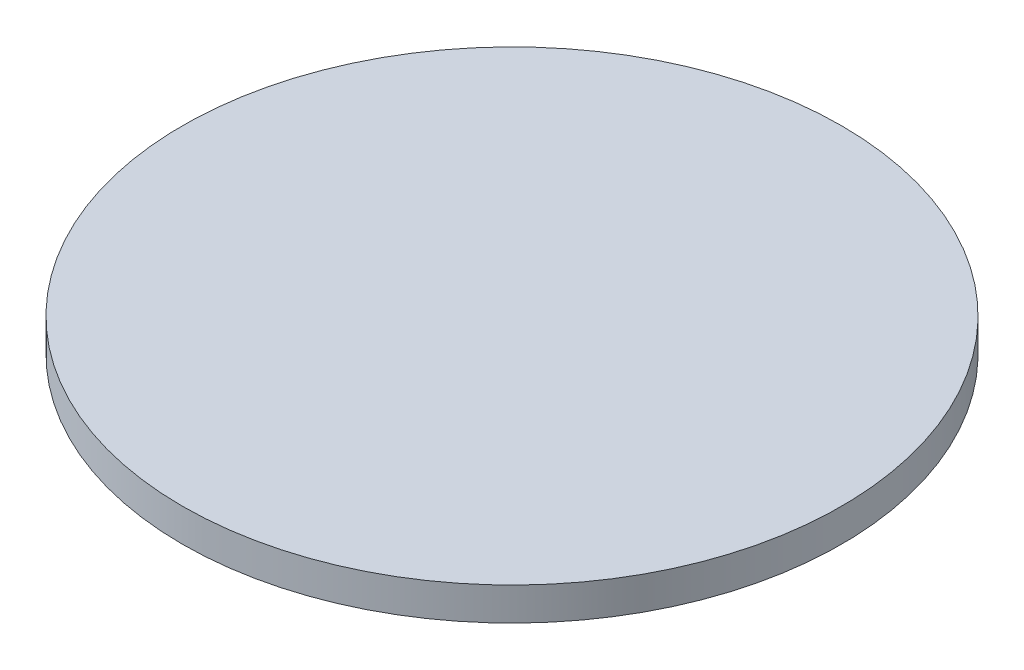
ISO-10303-21;
HEADER;
FILE_DESCRIPTION(('STEP AP214'),'2;1');
FILE_NAME('part.step','',(''),(''),'','','');
FILE_SCHEMA(('AUTOMOTIVE_DESIGN { 1 0 10303 214 1 1 1 1 }'));
ENDSEC;
DATA;
#1=APPLICATION_CONTEXT('core data for automotive mechanical design processes');
#2=APPLICATION_PROTOCOL_DEFINITION('international standard','automotive_design',2000,#1);
#3=PRODUCT_CONTEXT('',#1,'mechanical');
#4=PRODUCT('Part','Part','',(#3));
#5=PRODUCT_RELATED_PRODUCT_CATEGORY('part','',(#4));
#6=PRODUCT_DEFINITION_FORMATION('','',#4);
#7=PRODUCT_DEFINITION_CONTEXT('part definition',#1,'design');
#8=PRODUCT_DEFINITION('design','',#6,#7);
#9=PRODUCT_DEFINITION_SHAPE('','',#8);
#10=(LENGTH_UNIT() NAMED_UNIT(*) SI_UNIT(.MILLI.,.METRE.));
#11=(NAMED_UNIT(*) PLANE_ANGLE_UNIT() SI_UNIT($,.RADIAN.));
#12=(NAMED_UNIT(*) SI_UNIT($,.STERADIAN.) SOLID_ANGLE_UNIT());
#13=UNCERTAINTY_MEASURE_WITH_UNIT(LENGTH_MEASURE(1.E-05),#10,'distance_accuracy_value','');
#14=(GEOMETRIC_REPRESENTATION_CONTEXT(3) GLOBAL_UNCERTAINTY_ASSIGNED_CONTEXT((#13)) GLOBAL_UNIT_ASSIGNED_CONTEXT((#10,
#11,#12)) REPRESENTATION_CONTEXT('',''));
#15=CARTESIAN_POINT('',(0.,0.,0.));
#16=DIRECTION('',(0.,0.,1.));
#17=DIRECTION('',(1.,0.,0.));
#18=AXIS2_PLACEMENT_3D('',#15,#16,#17);
#19=CARTESIAN_POINT('',(0.,5.,0.));
#20=DIRECTION('',(0.,-1.,0.));
#21=DIRECTION('',(0.,0.,-1.));
#22=AXIS2_PLACEMENT_3D('',#19,#20,#21);
#23=CYLINDRICAL_SURFACE('',#22,50.);
#24=CARTESIAN_POINT('',(0.,5.,0.));
#25=DIRECTION('',(0.,1.,0.));
#26=DIRECTION('',(0.,0.,1.));
#27=AXIS2_PLACEMENT_3D('',#24,#25,#26);
#28=CIRCLE('',#27,50.);
#29=CARTESIAN_POINT('',(0.,5.,50.));
#30=VERTEX_POINT('',#29);
#31=EDGE_CURVE('E10',#30,#30,#28,.T.);
#32=ORIENTED_EDGE('',*,*,#31,.F.);
#33=EDGE_LOOP('',(#32));
#34=FACE_BOUND('',#33,.T.);
#35=CARTESIAN_POINT('',(0.,0.,0.));
#36=DIRECTION('',(0.,1.,0.));
#37=DIRECTION('',(0.,0.,1.));
#38=AXIS2_PLACEMENT_3D('',#35,#36,#37);
#39=CIRCLE('',#38,50.);
#40=CARTESIAN_POINT('',(0.,0.,50.));
#41=VERTEX_POINT('',#40);
#42=EDGE_CURVE('E39',#41,#41,#39,.T.);
#43=ORIENTED_EDGE('',*,*,#42,.T.);
#44=EDGE_LOOP('',(#43));
#45=FACE_BOUND('',#44,.T.);
#46=ADVANCED_FACE('F36',(#34,#45),#23,.T.);
#47=CARTESIAN_POINT('',(0.,5.,0.));
#48=DIRECTION('',(0.,1.,0.));
#49=DIRECTION('',(0.,0.,1.));
#50=AXIS2_PLACEMENT_3D('',#47,#48,#49);
#51=PLANE('',#50);
#52=ORIENTED_EDGE('',*,*,#31,.T.);
#53=EDGE_LOOP('',(#52));
#54=FACE_BOUND('',#53,.T.);
#55=ADVANCED_FACE('F51',(#54),#51,.T.);
#56=CARTESIAN_POINT('',(0.,0.,0.));
#57=DIRECTION('',(0.,1.,0.));
#58=DIRECTION('',(0.,0.,1.));
#59=AXIS2_PLACEMENT_3D('',#56,#57,#58);
#60=PLANE('',#59);
#61=ORIENTED_EDGE('',*,*,#42,.F.);
#62=EDGE_LOOP('',(#61));
#63=FACE_BOUND('',#62,.T.);
#64=ADVANCED_FACE('F49',(#63),#60,.F.);
#65=CLOSED_SHELL('',(#46,#55,#64));
#66=MANIFOLD_SOLID_BREP('B2',#65);
#67=ADVANCED_BREP_SHAPE_REPRESENTATION('',(#18,#66),#14);
#68=SHAPE_DEFINITION_REPRESENTATION(#9,#67);
ENDSEC;
END-ISO-10303-21;
